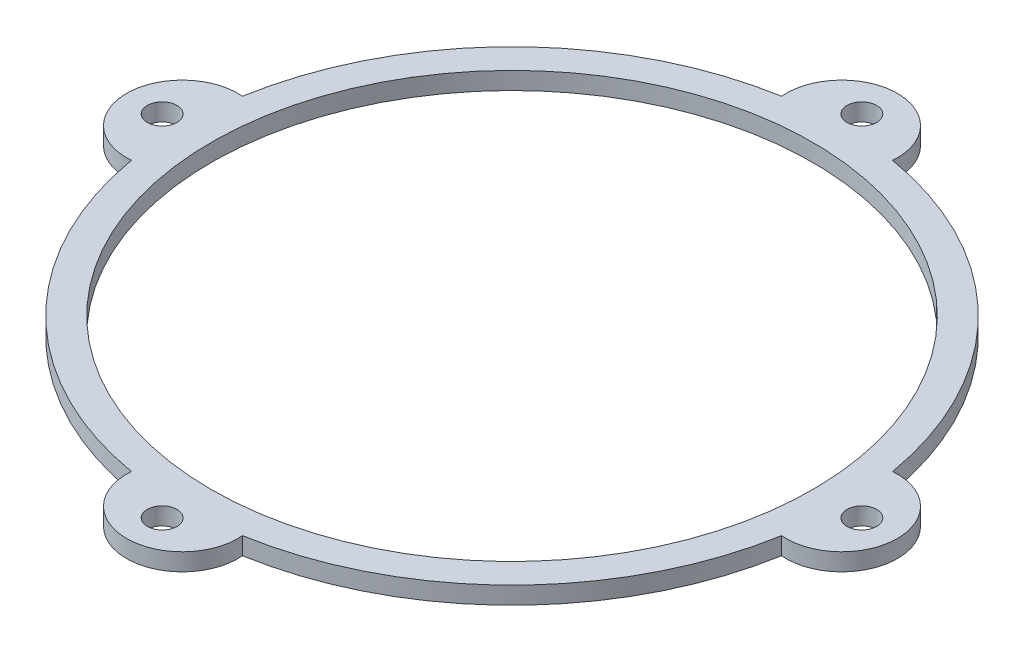
ISO-10303-21;
HEADER;
FILE_DESCRIPTION(('STEP AP214'),'2;1');
FILE_NAME('part.step','',(''),(''),'','','');
FILE_SCHEMA(('AUTOMOTIVE_DESIGN { 1 0 10303 214 1 1 1 1 }'));
ENDSEC;
DATA;
#1=APPLICATION_CONTEXT('core data for automotive mechanical design processes');
#2=APPLICATION_PROTOCOL_DEFINITION('international standard','automotive_design',2000,#1);
#3=PRODUCT_CONTEXT('',#1,'mechanical');
#4=PRODUCT('Part','Part','',(#3));
#5=PRODUCT_RELATED_PRODUCT_CATEGORY('part','',(#4));
#6=PRODUCT_DEFINITION_FORMATION('','',#4);
#7=PRODUCT_DEFINITION_CONTEXT('part definition',#1,'design');
#8=PRODUCT_DEFINITION('design','',#6,#7);
#9=PRODUCT_DEFINITION_SHAPE('','',#8);
#10=(LENGTH_UNIT() NAMED_UNIT(*) SI_UNIT(.MILLI.,.METRE.));
#11=(NAMED_UNIT(*) PLANE_ANGLE_UNIT() SI_UNIT($,.RADIAN.));
#12=(NAMED_UNIT(*) SI_UNIT($,.STERADIAN.) SOLID_ANGLE_UNIT());
#13=UNCERTAINTY_MEASURE_WITH_UNIT(LENGTH_MEASURE(1.E-05),#10,'distance_accuracy_value','');
#14=(GEOMETRIC_REPRESENTATION_CONTEXT(3) GLOBAL_UNCERTAINTY_ASSIGNED_CONTEXT((#13)) GLOBAL_UNIT_ASSIGNED_CONTEXT((#10,
#11,#12)) REPRESENTATION_CONTEXT('',''));
#15=CARTESIAN_POINT('',(0.,0.,0.));
#16=DIRECTION('',(0.,0.,1.));
#17=DIRECTION('',(1.,0.,0.));
#18=AXIS2_PLACEMENT_3D('',#15,#16,#17);
#19=CARTESIAN_POINT('',(0.,2.,0.));
#20=DIRECTION('',(0.,1.,0.));
#21=DIRECTION('',(0.,0.,1.));
#22=AXIS2_PLACEMENT_3D('',#19,#20,#21);
#23=PLANE('',#22);
#24=CARTESIAN_POINT('',(0.,2.,-40.1331454305621));
#25=DIRECTION('',(0.,1.,0.));
#26=DIRECTION('',(0.,0.,1.));
#27=AXIS2_PLACEMENT_3D('',#24,#25,#26);
#28=CIRCLE('',#27,1.7);
#29=CARTESIAN_POINT('',(0.,2.,-38.4331454305621));
#30=VERTEX_POINT('',#29);
#31=EDGE_CURVE('E248',#30,#30,#28,.T.);
#32=ORIENTED_EDGE('',*,*,#31,.F.);
#33=EDGE_LOOP('',(#32));
#34=FACE_BOUND('',#33,.T.);
#35=CARTESIAN_POINT('',(-40.1331454305621,2.,0.));
#36=DIRECTION('',(0.,1.,0.));
#37=DIRECTION('',(0.,0.,1.));
#38=AXIS2_PLACEMENT_3D('',#35,#36,#37);
#39=CIRCLE('',#38,1.7);
#40=CARTESIAN_POINT('',(-40.1331454305621,2.,1.7));
#41=VERTEX_POINT('',#40);
#42=EDGE_CURVE('E249',#41,#41,#39,.T.);
#43=ORIENTED_EDGE('',*,*,#42,.F.);
#44=EDGE_LOOP('',(#43));
#45=FACE_BOUND('',#44,.T.);
#46=CARTESIAN_POINT('',(0.,2.,40.1331454305621));
#47=DIRECTION('',(0.,1.,0.));
#48=DIRECTION('',(0.,0.,1.));
#49=AXIS2_PLACEMENT_3D('',#46,#47,#48);
#50=CIRCLE('',#49,1.7);
#51=CARTESIAN_POINT('',(0.,2.,41.8331454305621));
#52=VERTEX_POINT('',#51);
#53=EDGE_CURVE('E258',#52,#52,#50,.T.);
#54=ORIENTED_EDGE('',*,*,#53,.F.);
#55=EDGE_LOOP('',(#54));
#56=FACE_BOUND('',#55,.T.);
#57=CARTESIAN_POINT('',(40.1331454305621,2.,0.));
#58=DIRECTION('',(0.,1.,0.));
#59=DIRECTION('',(0.,0.,1.));
#60=AXIS2_PLACEMENT_3D('',#57,#58,#59);
#61=CIRCLE('',#60,1.7);
#62=CARTESIAN_POINT('',(40.1331454305621,2.,1.7));
#63=VERTEX_POINT('',#62);
#64=EDGE_CURVE('E263',#63,#63,#61,.T.);
#65=ORIENTED_EDGE('',*,*,#64,.F.);
#66=EDGE_LOOP('',(#65));
#67=FACE_BOUND('',#66,.T.);
#68=CARTESIAN_POINT('',(0.,2.,0.));
#69=DIRECTION('',(0.,1.,0.));
#70=DIRECTION('',(0.,0.,1.));
#71=AXIS2_PLACEMENT_3D('',#68,#69,#70);
#72=CIRCLE('',#71,34.5);
#73=CARTESIAN_POINT('',(0.,2.,34.5));
#74=VERTEX_POINT('',#73);
#75=EDGE_CURVE('E43',#74,#74,#72,.T.);
#76=ORIENTED_EDGE('',*,*,#75,.F.);
#77=EDGE_LOOP('',(#76));
#78=FACE_BOUND('',#77,.T.);
#79=CARTESIAN_POINT('',(0.,2.,0.));
#80=DIRECTION('',(0.,1.,0.));
#81=DIRECTION('',(0.,0.,1.));
#82=AXIS2_PLACEMENT_3D('',#79,#80,#81);
#83=CIRCLE('',#82,37.825);
#84=CARTESIAN_POINT('',(-37.2847500495933,2.,6.37008938236739));
#85=VERTEX_POINT('',#84);
#86=CARTESIAN_POINT('',(-6.37008938236739,2.,37.2847500495933));
#87=VERTEX_POINT('',#86);
#88=EDGE_CURVE('E127',#85,#87,#83,.T.);
#89=ORIENTED_EDGE('',*,*,#88,.T.);
#90=CARTESIAN_POINT('',(0.,2.,37.825));
#91=DIRECTION('',(0.,1.,0.));
#92=DIRECTION('',(0.,0.,1.));
#93=AXIS2_PLACEMENT_3D('',#90,#91,#92);
#94=CIRCLE('',#93,6.39295774647887);
#95=CARTESIAN_POINT('',(6.37008938236739,2.,37.2847500495933));
#96=VERTEX_POINT('',#95);
#97=EDGE_CURVE('E54',#87,#96,#94,.T.);
#98=ORIENTED_EDGE('',*,*,#97,.T.);
#99=CARTESIAN_POINT('',(37.2847500495933,2.,6.37008938236739));
#100=VERTEX_POINT('',#99);
#101=EDGE_CURVE('E121',#96,#100,#83,.T.);
#102=ORIENTED_EDGE('',*,*,#101,.T.);
#103=CARTESIAN_POINT('',(37.825,2.,0.));
#104=DIRECTION('',(0.,1.,0.));
#105=DIRECTION('',(0.,0.,1.));
#106=AXIS2_PLACEMENT_3D('',#103,#104,#105);
#107=CIRCLE('',#106,6.39295774647887);
#108=CARTESIAN_POINT('',(37.2847500495933,2.,-6.37008938236739));
#109=VERTEX_POINT('',#108);
#110=EDGE_CURVE('E124',#109,#100,#107,.F.);
#111=ORIENTED_EDGE('',*,*,#110,.F.);
#112=CARTESIAN_POINT('',(6.37008938236739,2.,-37.2847500495933));
#113=VERTEX_POINT('',#112);
#114=EDGE_CURVE('E126',#109,#113,#83,.T.);
#115=ORIENTED_EDGE('',*,*,#114,.T.);
#116=CARTESIAN_POINT('',(0.,2.,-37.825));
#117=DIRECTION('',(0.,1.,0.));
#118=DIRECTION('',(0.,0.,1.));
#119=AXIS2_PLACEMENT_3D('',#116,#117,#118);
#120=CIRCLE('',#119,6.39295774647887);
#121=CARTESIAN_POINT('',(-6.37008938236739,2.,-37.2847500495933));
#122=VERTEX_POINT('',#121);
#123=EDGE_CURVE('E145',#122,#113,#120,.F.);
#124=ORIENTED_EDGE('',*,*,#123,.F.);
#125=CARTESIAN_POINT('',(-37.2847500495933,2.,-6.37008938236739));
#126=VERTEX_POINT('',#125);
#127=EDGE_CURVE('E142',#122,#126,#83,.T.);
#128=ORIENTED_EDGE('',*,*,#127,.T.);
#129=CARTESIAN_POINT('',(-37.825,2.,0.));
#130=DIRECTION('',(0.,1.,0.));
#131=DIRECTION('',(0.,0.,1.));
#132=AXIS2_PLACEMENT_3D('',#129,#130,#131);
#133=CIRCLE('',#132,6.39295774647887);
#134=EDGE_CURVE('E141',#126,#85,#133,.T.);
#135=ORIENTED_EDGE('',*,*,#134,.T.);
#136=EDGE_LOOP('',(#89,#98,#102,#111,#115,#124,#128,#135));
#137=FACE_BOUND('',#136,.T.);
#138=ADVANCED_FACE('F39',(#34,#45,#56,#67,#78,#137),#23,.T.);
#139=CARTESIAN_POINT('',(0.,0.,0.));
#140=DIRECTION('',(0.,1.,0.));
#141=DIRECTION('',(0.,0.,1.));
#142=AXIS2_PLACEMENT_3D('',#139,#140,#141);
#143=PLANE('',#142);
#144=CARTESIAN_POINT('',(0.,0.,-40.1331454305621));
#145=DIRECTION('',(0.,1.,0.));
#146=DIRECTION('',(0.,0.,1.));
#147=AXIS2_PLACEMENT_3D('',#144,#145,#146);
#148=CIRCLE('',#147,1.7);
#149=CARTESIAN_POINT('',(0.,0.,-38.4331454305621));
#150=VERTEX_POINT('',#149);
#151=EDGE_CURVE('E139',#150,#150,#148,.T.);
#152=ORIENTED_EDGE('',*,*,#151,.T.);
#153=EDGE_LOOP('',(#152));
#154=FACE_BOUND('',#153,.T.);
#155=CARTESIAN_POINT('',(-40.1331454305621,0.,0.));
#156=DIRECTION('',(0.,1.,0.));
#157=DIRECTION('',(0.,0.,1.));
#158=AXIS2_PLACEMENT_3D('',#155,#156,#157);
#159=CIRCLE('',#158,1.7);
#160=CARTESIAN_POINT('',(-40.1331454305621,0.,1.7));
#161=VERTEX_POINT('',#160);
#162=EDGE_CURVE('E253',#161,#161,#159,.T.);
#163=ORIENTED_EDGE('',*,*,#162,.T.);
#164=EDGE_LOOP('',(#163));
#165=FACE_BOUND('',#164,.T.);
#166=CARTESIAN_POINT('',(0.,0.,40.1331454305621));
#167=DIRECTION('',(0.,1.,0.));
#168=DIRECTION('',(0.,0.,1.));
#169=AXIS2_PLACEMENT_3D('',#166,#167,#168);
#170=CIRCLE('',#169,1.7);
#171=CARTESIAN_POINT('',(0.,0.,41.8331454305621));
#172=VERTEX_POINT('',#171);
#173=EDGE_CURVE('E261',#172,#172,#170,.T.);
#174=ORIENTED_EDGE('',*,*,#173,.T.);
#175=EDGE_LOOP('',(#174));
#176=FACE_BOUND('',#175,.T.);
#177=CARTESIAN_POINT('',(40.1331454305621,0.,0.));
#178=DIRECTION('',(0.,1.,0.));
#179=DIRECTION('',(0.,0.,1.));
#180=AXIS2_PLACEMENT_3D('',#177,#178,#179);
#181=CIRCLE('',#180,1.7);
#182=CARTESIAN_POINT('',(40.1331454305621,0.,1.7));
#183=VERTEX_POINT('',#182);
#184=EDGE_CURVE('E129',#183,#183,#181,.T.);
#185=ORIENTED_EDGE('',*,*,#184,.T.);
#186=EDGE_LOOP('',(#185));
#187=FACE_BOUND('',#186,.T.);
#188=CARTESIAN_POINT('',(0.,0.,0.));
#189=DIRECTION('',(0.,1.,0.));
#190=DIRECTION('',(0.,0.,1.));
#191=AXIS2_PLACEMENT_3D('',#188,#189,#190);
#192=CIRCLE('',#191,34.5);
#193=CARTESIAN_POINT('',(0.,0.,34.5));
#194=VERTEX_POINT('',#193);
#195=EDGE_CURVE('E11',#194,#194,#192,.T.);
#196=ORIENTED_EDGE('',*,*,#195,.T.);
#197=EDGE_LOOP('',(#196));
#198=FACE_BOUND('',#197,.T.);
#199=CARTESIAN_POINT('',(0.,0.,37.825));
#200=DIRECTION('',(0.,1.,0.));
#201=DIRECTION('',(0.,0.,1.));
#202=AXIS2_PLACEMENT_3D('',#199,#200,#201);
#203=CIRCLE('',#202,6.39295774647887);
#204=CARTESIAN_POINT('',(-6.37008938236739,0.,37.2847500495933));
#205=VERTEX_POINT('',#204);
#206=CARTESIAN_POINT('',(6.37008938236739,0.,37.2847500495933));
#207=VERTEX_POINT('',#206);
#208=EDGE_CURVE('E112',#205,#207,#203,.T.);
#209=ORIENTED_EDGE('',*,*,#208,.F.);
#210=CARTESIAN_POINT('',(0.,0.,0.));
#211=DIRECTION('',(0.,1.,0.));
#212=DIRECTION('',(0.,0.,1.));
#213=AXIS2_PLACEMENT_3D('',#210,#211,#212);
#214=CIRCLE('',#213,37.825);
#215=CARTESIAN_POINT('',(-37.2847500495933,0.,6.37008938236739));
#216=VERTEX_POINT('',#215);
#217=EDGE_CURVE('E104',#216,#205,#214,.T.);
#218=ORIENTED_EDGE('',*,*,#217,.F.);
#219=CARTESIAN_POINT('',(-37.825,0.,0.));
#220=DIRECTION('',(0.,1.,0.));
#221=DIRECTION('',(0.,0.,1.));
#222=AXIS2_PLACEMENT_3D('',#219,#220,#221);
#223=CIRCLE('',#222,6.39295774647887);
#224=CARTESIAN_POINT('',(-37.2847500495933,0.,-6.37008938236739));
#225=VERTEX_POINT('',#224);
#226=EDGE_CURVE('E111',#225,#216,#223,.T.);
#227=ORIENTED_EDGE('',*,*,#226,.F.);
#228=CARTESIAN_POINT('',(-6.37008938236739,0.,-37.2847500495933));
#229=VERTEX_POINT('',#228);
#230=EDGE_CURVE('E115',#229,#225,#214,.T.);
#231=ORIENTED_EDGE('',*,*,#230,.F.);
#232=CARTESIAN_POINT('',(0.,0.,-37.825));
#233=DIRECTION('',(0.,1.,0.));
#234=DIRECTION('',(0.,0.,1.));
#235=AXIS2_PLACEMENT_3D('',#232,#233,#234);
#236=CIRCLE('',#235,6.39295774647887);
#237=CARTESIAN_POINT('',(6.37008938236739,0.,-37.2847500495933));
#238=VERTEX_POINT('',#237);
#239=EDGE_CURVE('E133',#229,#238,#236,.F.);
#240=ORIENTED_EDGE('',*,*,#239,.T.);
#241=CARTESIAN_POINT('',(37.2847500495933,0.,-6.37008938236739));
#242=VERTEX_POINT('',#241);
#243=EDGE_CURVE('E136',#242,#238,#214,.T.);
#244=ORIENTED_EDGE('',*,*,#243,.F.);
#245=CARTESIAN_POINT('',(37.825,0.,0.));
#246=DIRECTION('',(0.,1.,0.));
#247=DIRECTION('',(0.,0.,1.));
#248=AXIS2_PLACEMENT_3D('',#245,#246,#247);
#249=CIRCLE('',#248,6.39295774647887);
#250=CARTESIAN_POINT('',(37.2847500495933,0.,6.37008938236739));
#251=VERTEX_POINT('',#250);
#252=EDGE_CURVE('E137',#242,#251,#249,.F.);
#253=ORIENTED_EDGE('',*,*,#252,.T.);
#254=EDGE_CURVE('E114',#207,#251,#214,.T.);
#255=ORIENTED_EDGE('',*,*,#254,.F.);
#256=EDGE_LOOP('',(#209,#218,#227,#231,#240,#244,#253,#255));
#257=FACE_BOUND('',#256,.T.);
#258=ADVANCED_FACE('F41',(#154,#165,#176,#187,#198,#257),#143,.F.);
#259=CARTESIAN_POINT('',(0.,0.,0.));
#260=DIRECTION('',(0.,1.,0.));
#261=DIRECTION('',(0.,0.,1.));
#262=AXIS2_PLACEMENT_3D('',#259,#260,#261);
#263=CYLINDRICAL_SURFACE('',#262,34.5);
#264=ORIENTED_EDGE('',*,*,#195,.F.);
#265=EDGE_LOOP('',(#264));
#266=FACE_BOUND('',#265,.T.);
#267=ORIENTED_EDGE('',*,*,#75,.T.);
#268=EDGE_LOOP('',(#267));
#269=FACE_BOUND('',#268,.T.);
#270=ADVANCED_FACE('F202',(#266,#269),#263,.F.);
#271=CARTESIAN_POINT('',(0.,0.,37.825));
#272=DIRECTION('',(0.,1.,0.));
#273=DIRECTION('',(0.,0.,1.));
#274=AXIS2_PLACEMENT_3D('',#271,#272,#273);
#275=CYLINDRICAL_SURFACE('',#274,6.39295774647887);
#276=ORIENTED_EDGE('',*,*,#97,.F.);
#277=DIRECTION('',(0.,1.,0.));
#278=VECTOR('',#277,1.);
#279=CARTESIAN_POINT('',(-6.37008938236739,0.,37.2847500495933));
#280=LINE('',#279,#278);
#281=EDGE_CURVE('E106',#205,#87,#280,.T.);
#282=ORIENTED_EDGE('',*,*,#281,.F.);
#283=ORIENTED_EDGE('',*,*,#208,.T.);
#284=DIRECTION('',(0.,1.,0.));
#285=VECTOR('',#284,1.);
#286=CARTESIAN_POINT('',(6.37008938236739,0.,37.2847500495933));
#287=LINE('',#286,#285);
#288=EDGE_CURVE('E150',#207,#96,#287,.T.);
#289=ORIENTED_EDGE('',*,*,#288,.T.);
#290=EDGE_LOOP('',(#276,#282,#283,#289));
#291=FACE_BOUND('',#290,.T.);
#292=ADVANCED_FACE('F116',(#291),#275,.T.);
#293=CARTESIAN_POINT('',(0.,0.,0.));
#294=DIRECTION('',(0.,1.,0.));
#295=DIRECTION('',(0.,0.,1.));
#296=AXIS2_PLACEMENT_3D('',#293,#294,#295);
#297=CYLINDRICAL_SURFACE('',#296,37.825);
#298=ORIENTED_EDGE('',*,*,#101,.F.);
#299=ORIENTED_EDGE('',*,*,#288,.F.);
#300=ORIENTED_EDGE('',*,*,#254,.T.);
#301=DIRECTION('',(0.,1.,0.));
#302=VECTOR('',#301,1.);
#303=CARTESIAN_POINT('',(37.2847500495933,0.,6.37008938236739));
#304=LINE('',#303,#302);
#305=EDGE_CURVE('E152',#251,#100,#304,.T.);
#306=ORIENTED_EDGE('',*,*,#305,.T.);
#307=EDGE_LOOP('',(#298,#299,#300,#306));
#308=FACE_BOUND('',#307,.T.);
#309=ADVANCED_FACE('F186',(#308),#297,.T.);
#310=CARTESIAN_POINT('',(37.825,0.,0.));
#311=DIRECTION('',(0.,1.,0.));
#312=DIRECTION('',(0.,0.,1.));
#313=AXIS2_PLACEMENT_3D('',#310,#311,#312);
#314=CYLINDRICAL_SURFACE('',#313,6.39295774647887);
#315=ORIENTED_EDGE('',*,*,#110,.T.);
#316=ORIENTED_EDGE('',*,*,#305,.F.);
#317=ORIENTED_EDGE('',*,*,#252,.F.);
#318=DIRECTION('',(0.,1.,0.));
#319=VECTOR('',#318,1.);
#320=CARTESIAN_POINT('',(37.2847500495933,0.,-6.37008938236739));
#321=LINE('',#320,#319);
#322=EDGE_CURVE('E154',#242,#109,#321,.T.);
#323=ORIENTED_EDGE('',*,*,#322,.T.);
#324=EDGE_LOOP('',(#315,#316,#317,#323));
#325=FACE_BOUND('',#324,.T.);
#326=ADVANCED_FACE('F188',(#325),#314,.T.);
#327=ORIENTED_EDGE('',*,*,#114,.F.);
#328=ORIENTED_EDGE('',*,*,#322,.F.);
#329=ORIENTED_EDGE('',*,*,#243,.T.);
#330=DIRECTION('',(0.,1.,0.));
#331=VECTOR('',#330,1.);
#332=CARTESIAN_POINT('',(6.37008938236739,0.,-37.2847500495933));
#333=LINE('',#332,#331);
#334=EDGE_CURVE('E156',#238,#113,#333,.T.);
#335=ORIENTED_EDGE('',*,*,#334,.T.);
#336=EDGE_LOOP('',(#327,#328,#329,#335));
#337=FACE_BOUND('',#336,.T.);
#338=ADVANCED_FACE('F175',(#337),#297,.T.);
#339=CARTESIAN_POINT('',(0.,0.,-37.825));
#340=DIRECTION('',(0.,1.,0.));
#341=DIRECTION('',(0.,0.,1.));
#342=AXIS2_PLACEMENT_3D('',#339,#340,#341);
#343=CYLINDRICAL_SURFACE('',#342,6.39295774647887);
#344=ORIENTED_EDGE('',*,*,#123,.T.);
#345=ORIENTED_EDGE('',*,*,#334,.F.);
#346=ORIENTED_EDGE('',*,*,#239,.F.);
#347=DIRECTION('',(0.,1.,0.));
#348=VECTOR('',#347,1.);
#349=CARTESIAN_POINT('',(-6.37008938236739,0.,-37.2847500495933));
#350=LINE('',#349,#348);
#351=EDGE_CURVE('E158',#229,#122,#350,.T.);
#352=ORIENTED_EDGE('',*,*,#351,.T.);
#353=EDGE_LOOP('',(#344,#345,#346,#352));
#354=FACE_BOUND('',#353,.T.);
#355=ADVANCED_FACE('F181',(#354),#343,.T.);
#356=ORIENTED_EDGE('',*,*,#127,.F.);
#357=ORIENTED_EDGE('',*,*,#351,.F.);
#358=ORIENTED_EDGE('',*,*,#230,.T.);
#359=DIRECTION('',(0.,1.,0.));
#360=VECTOR('',#359,1.);
#361=CARTESIAN_POINT('',(-37.2847500495933,0.,-6.37008938236739));
#362=LINE('',#361,#360);
#363=EDGE_CURVE('E160',#225,#126,#362,.T.);
#364=ORIENTED_EDGE('',*,*,#363,.T.);
#365=EDGE_LOOP('',(#356,#357,#358,#364));
#366=FACE_BOUND('',#365,.T.);
#367=ADVANCED_FACE('F183',(#366),#297,.T.);
#368=CARTESIAN_POINT('',(-37.825,0.,0.));
#369=DIRECTION('',(0.,1.,0.));
#370=DIRECTION('',(0.,0.,1.));
#371=AXIS2_PLACEMENT_3D('',#368,#369,#370);
#372=CYLINDRICAL_SURFACE('',#371,6.39295774647887);
#373=ORIENTED_EDGE('',*,*,#134,.F.);
#374=ORIENTED_EDGE('',*,*,#363,.F.);
#375=ORIENTED_EDGE('',*,*,#226,.T.);
#376=DIRECTION('',(0.,1.,0.));
#377=VECTOR('',#376,1.);
#378=CARTESIAN_POINT('',(-37.2847500495933,0.,6.37008938236739));
#379=LINE('',#378,#377);
#380=EDGE_CURVE('E62',#216,#85,#379,.T.);
#381=ORIENTED_EDGE('',*,*,#380,.T.);
#382=EDGE_LOOP('',(#373,#374,#375,#381));
#383=FACE_BOUND('',#382,.T.);
#384=ADVANCED_FACE('F164',(#383),#372,.T.);
#385=ORIENTED_EDGE('',*,*,#88,.F.);
#386=ORIENTED_EDGE('',*,*,#380,.F.);
#387=ORIENTED_EDGE('',*,*,#217,.T.);
#388=ORIENTED_EDGE('',*,*,#281,.T.);
#389=EDGE_LOOP('',(#385,#386,#387,#388));
#390=FACE_BOUND('',#389,.T.);
#391=ADVANCED_FACE('F105',(#390),#297,.T.);
#392=CARTESIAN_POINT('',(40.1331454305621,0.,0.));
#393=DIRECTION('',(0.,1.,0.));
#394=DIRECTION('',(0.,0.,1.));
#395=AXIS2_PLACEMENT_3D('',#392,#393,#394);
#396=CYLINDRICAL_SURFACE('',#395,1.7);
#397=ORIENTED_EDGE('',*,*,#184,.F.);
#398=EDGE_LOOP('',(#397));
#399=FACE_BOUND('',#398,.T.);
#400=ORIENTED_EDGE('',*,*,#64,.T.);
#401=EDGE_LOOP('',(#400));
#402=FACE_BOUND('',#401,.T.);
#403=ADVANCED_FACE('F221',(#399,#402),#396,.F.);
#404=CARTESIAN_POINT('',(0.,0.,40.1331454305621));
#405=DIRECTION('',(0.,1.,0.));
#406=DIRECTION('',(0.,0.,1.));
#407=AXIS2_PLACEMENT_3D('',#404,#405,#406);
#408=CYLINDRICAL_SURFACE('',#407,1.7);
#409=ORIENTED_EDGE('',*,*,#173,.F.);
#410=EDGE_LOOP('',(#409));
#411=FACE_BOUND('',#410,.T.);
#412=ORIENTED_EDGE('',*,*,#53,.T.);
#413=EDGE_LOOP('',(#412));
#414=FACE_BOUND('',#413,.T.);
#415=ADVANCED_FACE('F225',(#411,#414),#408,.F.);
#416=CARTESIAN_POINT('',(-40.1331454305621,0.,0.));
#417=DIRECTION('',(0.,1.,0.));
#418=DIRECTION('',(0.,0.,1.));
#419=AXIS2_PLACEMENT_3D('',#416,#417,#418);
#420=CYLINDRICAL_SURFACE('',#419,1.7);
#421=ORIENTED_EDGE('',*,*,#162,.F.);
#422=EDGE_LOOP('',(#421));
#423=FACE_BOUND('',#422,.T.);
#424=ORIENTED_EDGE('',*,*,#42,.T.);
#425=EDGE_LOOP('',(#424));
#426=FACE_BOUND('',#425,.T.);
#427=ADVANCED_FACE('F230',(#423,#426),#420,.F.);
#428=CARTESIAN_POINT('',(0.,0.,-40.1331454305621));
#429=DIRECTION('',(0.,1.,0.));
#430=DIRECTION('',(0.,0.,1.));
#431=AXIS2_PLACEMENT_3D('',#428,#429,#430);
#432=CYLINDRICAL_SURFACE('',#431,1.7);
#433=ORIENTED_EDGE('',*,*,#151,.F.);
#434=EDGE_LOOP('',(#433));
#435=FACE_BOUND('',#434,.T.);
#436=ORIENTED_EDGE('',*,*,#31,.T.);
#437=EDGE_LOOP('',(#436));
#438=FACE_BOUND('',#437,.T.);
#439=ADVANCED_FACE('F238',(#435,#438),#432,.F.);
#440=CLOSED_SHELL('',(#138,#258,#270,#292,#309,#326,#338,#355,#367,#384,#391,#403,#415,#427,#439));
#441=MANIFOLD_SOLID_BREP('B2',#440);
#442=ADVANCED_BREP_SHAPE_REPRESENTATION('',(#18,#441),#14);
#443=SHAPE_DEFINITION_REPRESENTATION(#9,#442);
ENDSEC;
END-ISO-10303-21;
